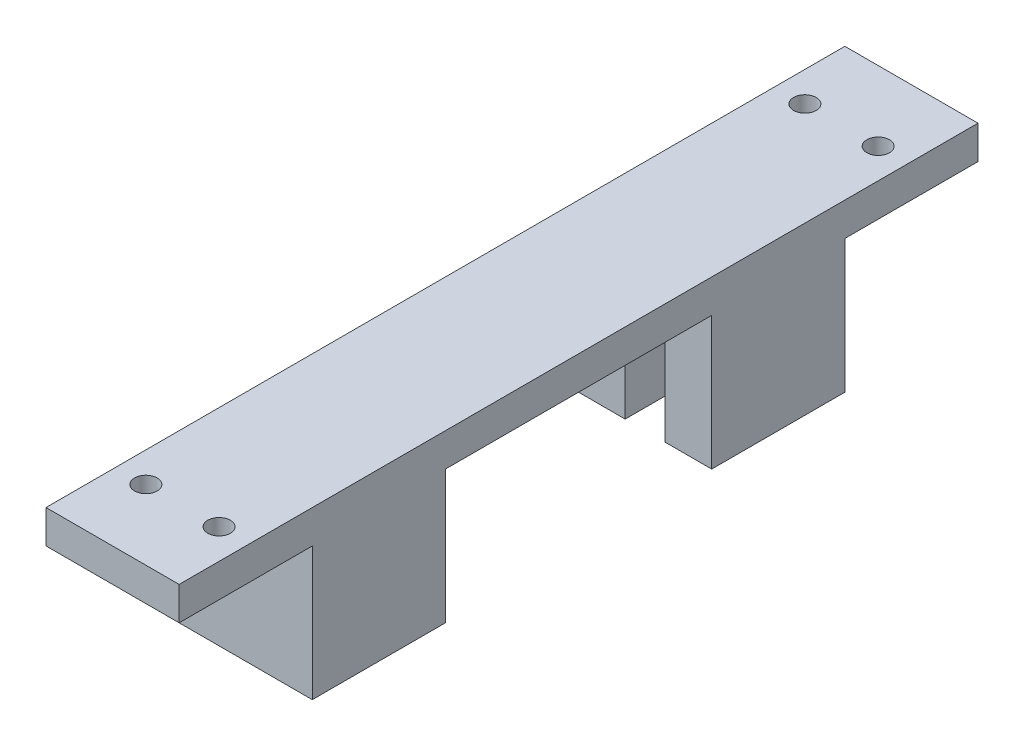
ISO-10303-21;
HEADER;
FILE_DESCRIPTION(('STEP AP214'),'2;1');
FILE_NAME('part.step','',(''),(''),'','','');
FILE_SCHEMA(('AUTOMOTIVE_DESIGN { 1 0 10303 214 1 1 1 1 }'));
ENDSEC;
DATA;
#1=APPLICATION_CONTEXT('core data for automotive mechanical design processes');
#2=APPLICATION_PROTOCOL_DEFINITION('international standard','automotive_design',2000,#1);
#3=PRODUCT_CONTEXT('',#1,'mechanical');
#4=PRODUCT('Part','Part','',(#3));
#5=PRODUCT_RELATED_PRODUCT_CATEGORY('part','',(#4));
#6=PRODUCT_DEFINITION_FORMATION('','',#4);
#7=PRODUCT_DEFINITION_CONTEXT('part definition',#1,'design');
#8=PRODUCT_DEFINITION('design','',#6,#7);
#9=PRODUCT_DEFINITION_SHAPE('','',#8);
#10=(LENGTH_UNIT() NAMED_UNIT(*) SI_UNIT(.MILLI.,.METRE.));
#11=(NAMED_UNIT(*) PLANE_ANGLE_UNIT() SI_UNIT($,.RADIAN.));
#12=(NAMED_UNIT(*) SI_UNIT($,.STERADIAN.) SOLID_ANGLE_UNIT());
#13=UNCERTAINTY_MEASURE_WITH_UNIT(LENGTH_MEASURE(1.E-05),#10,'distance_accuracy_value','');
#14=(GEOMETRIC_REPRESENTATION_CONTEXT(3) GLOBAL_UNCERTAINTY_ASSIGNED_CONTEXT((#13)) GLOBAL_UNIT_ASSIGNED_CONTEXT((#10,
#11,#12)) REPRESENTATION_CONTEXT('',''));
#15=CARTESIAN_POINT('',(0.,0.,0.));
#16=DIRECTION('',(0.,0.,1.));
#17=DIRECTION('',(1.,0.,0.));
#18=AXIS2_PLACEMENT_3D('',#15,#16,#17);
#19=CARTESIAN_POINT('',(10.,-20.,-60.));
#20=DIRECTION('',(0.,0.,-1.));
#21=DIRECTION('',(-1.,0.,0.));
#22=AXIS2_PLACEMENT_3D('',#19,#20,#21);
#23=PLANE('',#22);
#24=DIRECTION('',(-1.,0.,0.));
#25=VECTOR('',#24,1.);
#26=CARTESIAN_POINT('',(10.,-20.,-60.));
#27=LINE('',#26,#25);
#28=CARTESIAN_POINT('',(-3.,-20.,-60.));
#29=VERTEX_POINT('',#28);
#30=CARTESIAN_POINT('',(-10.,-20.,-60.));
#31=VERTEX_POINT('',#30);
#32=EDGE_CURVE('E214',#29,#31,#27,.T.);
#33=ORIENTED_EDGE('',*,*,#32,.F.);
#34=DIRECTION('',(0.,-1.,0.));
#35=VECTOR('',#34,1.);
#36=CARTESIAN_POINT('',(-3.,0.,-60.));
#37=LINE('',#36,#35);
#38=CARTESIAN_POINT('',(-3.,0.,-60.));
#39=VERTEX_POINT('',#38);
#40=EDGE_CURVE('E205',#39,#29,#37,.T.);
#41=ORIENTED_EDGE('',*,*,#40,.F.);
#42=DIRECTION('',(-1.,0.,0.));
#43=VECTOR('',#42,1.);
#44=CARTESIAN_POINT('',(10.,0.,-60.));
#45=LINE('',#44,#43);
#46=CARTESIAN_POINT('',(-10.,0.,-60.));
#47=VERTEX_POINT('',#46);
#48=EDGE_CURVE('E193',#39,#47,#45,.T.);
#49=ORIENTED_EDGE('',*,*,#48,.T.);
#50=DIRECTION('',(0.,1.,0.));
#51=VECTOR('',#50,1.);
#52=CARTESIAN_POINT('',(-10.,-20.,-60.));
#53=LINE('',#52,#51);
#54=EDGE_CURVE('E231',#31,#47,#53,.T.);
#55=ORIENTED_EDGE('',*,*,#54,.F.);
#56=EDGE_LOOP('',(#33,#41,#49,#55));
#57=FACE_BOUND('',#56,.T.);
#58=ADVANCED_FACE('F33',(#57),#23,.F.);
#59=CARTESIAN_POINT('',(0.,0.,0.));
#60=DIRECTION('',(0.,-1.,0.));
#61=DIRECTION('',(0.,0.,-1.));
#62=AXIS2_PLACEMENT_3D('',#59,#60,#61);
#63=PLANE('',#62);
#64=DIRECTION('',(0.,0.,1.));
#65=VECTOR('',#64,1.);
#66=CARTESIAN_POINT('',(-10.,0.,-80.));
#67=LINE('',#66,#65);
#68=CARTESIAN_POINT('',(-10.,0.,-20.));
#69=VERTEX_POINT('',#68);
#70=EDGE_CURVE('E261',#47,#69,#67,.T.);
#71=ORIENTED_EDGE('',*,*,#70,.F.);
#72=ORIENTED_EDGE('',*,*,#48,.F.);
#73=DIRECTION('',(0.,0.,-1.));
#74=VECTOR('',#73,1.);
#75=CARTESIAN_POINT('',(-3.,0.,-60.));
#76=LINE('',#75,#74);
#77=CARTESIAN_POINT('',(-3.,0.,-76.));
#78=VERTEX_POINT('',#77);
#79=EDGE_CURVE('E175',#39,#78,#76,.T.);
#80=ORIENTED_EDGE('',*,*,#79,.T.);
#81=DIRECTION('',(1.,0.,0.));
#82=VECTOR('',#81,1.);
#83=CARTESIAN_POINT('',(-3.,0.,-76.));
#84=LINE('',#83,#82);
#85=CARTESIAN_POINT('',(3.,0.,-76.));
#86=VERTEX_POINT('',#85);
#87=EDGE_CURVE('E184',#78,#86,#84,.T.);
#88=ORIENTED_EDGE('',*,*,#87,.T.);
#89=DIRECTION('',(0.,0.,1.));
#90=VECTOR('',#89,1.);
#91=CARTESIAN_POINT('',(3.,0.,-60.));
#92=LINE('',#91,#90);
#93=CARTESIAN_POINT('',(3.,0.,-60.));
#94=VERTEX_POINT('',#93);
#95=EDGE_CURVE('E181',#86,#94,#92,.T.);
#96=ORIENTED_EDGE('',*,*,#95,.T.);
#97=CARTESIAN_POINT('',(10.,0.,-60.));
#98=VERTEX_POINT('',#97);
#99=EDGE_CURVE('E224',#98,#94,#45,.T.);
#100=ORIENTED_EDGE('',*,*,#99,.F.);
#101=DIRECTION('',(0.,0.,1.));
#102=VECTOR('',#101,1.);
#103=CARTESIAN_POINT('',(10.,0.,-80.));
#104=LINE('',#103,#102);
#105=CARTESIAN_POINT('',(10.,0.,-20.));
#106=VERTEX_POINT('',#105);
#107=EDGE_CURVE('E37',#98,#106,#104,.T.);
#108=ORIENTED_EDGE('',*,*,#107,.T.);
#109=DIRECTION('',(-1.,0.,0.));
#110=VECTOR('',#109,1.);
#111=CARTESIAN_POINT('',(-10.,0.,-20.));
#112=LINE('',#111,#110);
#113=CARTESIAN_POINT('',(3.,0.,-20.));
#114=VERTEX_POINT('',#113);
#115=EDGE_CURVE('E248',#106,#114,#112,.T.);
#116=ORIENTED_EDGE('',*,*,#115,.T.);
#117=DIRECTION('',(0.,0.,1.));
#118=VECTOR('',#117,1.);
#119=CARTESIAN_POINT('',(3.,0.,-20.));
#120=LINE('',#119,#118);
#121=CARTESIAN_POINT('',(3.,0.,-4.));
#122=VERTEX_POINT('',#121);
#123=EDGE_CURVE('E281',#114,#122,#120,.T.);
#124=ORIENTED_EDGE('',*,*,#123,.T.);
#125=DIRECTION('',(-1.,0.,0.));
#126=VECTOR('',#125,1.);
#127=CARTESIAN_POINT('',(3.,0.,-4.));
#128=LINE('',#127,#126);
#129=CARTESIAN_POINT('',(-3.,0.,-4.));
#130=VERTEX_POINT('',#129);
#131=EDGE_CURVE('E284',#122,#130,#128,.T.);
#132=ORIENTED_EDGE('',*,*,#131,.T.);
#133=DIRECTION('',(0.,0.,-1.));
#134=VECTOR('',#133,1.);
#135=CARTESIAN_POINT('',(-3.,0.,-20.));
#136=LINE('',#135,#134);
#137=CARTESIAN_POINT('',(-3.,0.,-20.));
#138=VERTEX_POINT('',#137);
#139=EDGE_CURVE('E288',#130,#138,#136,.T.);
#140=ORIENTED_EDGE('',*,*,#139,.T.);
#141=EDGE_CURVE('E11',#138,#69,#112,.T.);
#142=ORIENTED_EDGE('',*,*,#141,.T.);
#143=EDGE_LOOP('',(#71,#72,#80,#88,#96,#100,#108,#116,#124,#132,#140,#142));
#144=FACE_BOUND('',#143,.T.);
#145=ADVANCED_FACE('F192',(#144),#63,.T.);
#146=CARTESIAN_POINT('',(5.5,0.,-89.5));
#147=DIRECTION('',(0.,-1.,0.));
#148=DIRECTION('',(0.,0.,-1.));
#149=AXIS2_PLACEMENT_3D('',#146,#147,#148);
#150=CIRCLE('',#149,1.69999999999999);
#151=CARTESIAN_POINT('',(5.5,0.,-91.2));
#152=VERTEX_POINT('',#151);
#153=EDGE_CURVE('E716',#152,#152,#150,.T.);
#154=ORIENTED_EDGE('',*,*,#153,.F.);
#155=EDGE_LOOP('',(#154));
#156=FACE_BOUND('',#155,.T.);
#157=CARTESIAN_POINT('',(-5.5,0.,-89.5));
#158=DIRECTION('',(0.,-1.,0.));
#159=DIRECTION('',(0.,0.,-1.));
#160=AXIS2_PLACEMENT_3D('',#157,#158,#159);
#161=CIRCLE('',#160,1.69999999999999);
#162=CARTESIAN_POINT('',(-5.5,0.,-91.2));
#163=VERTEX_POINT('',#162);
#164=EDGE_CURVE('E718',#163,#163,#161,.T.);
#165=ORIENTED_EDGE('',*,*,#164,.F.);
#166=EDGE_LOOP('',(#165));
#167=FACE_BOUND('',#166,.T.);
#168=CARTESIAN_POINT('',(10.,0.,-100.));
#169=VERTEX_POINT('',#168);
#170=CARTESIAN_POINT('',(10.,0.,-80.));
#171=VERTEX_POINT('',#170);
#172=EDGE_CURVE('E269',#169,#171,#104,.T.);
#173=ORIENTED_EDGE('',*,*,#172,.T.);
#174=DIRECTION('',(1.,0.,0.));
#175=VECTOR('',#174,1.);
#176=CARTESIAN_POINT('',(10.,0.,-80.));
#177=LINE('',#176,#175);
#178=CARTESIAN_POINT('',(-10.,0.,-80.));
#179=VERTEX_POINT('',#178);
#180=EDGE_CURVE('E215',#179,#171,#177,.T.);
#181=ORIENTED_EDGE('',*,*,#180,.F.);
#182=CARTESIAN_POINT('',(-10.,0.,-100.));
#183=VERTEX_POINT('',#182);
#184=EDGE_CURVE('E258',#183,#179,#67,.T.);
#185=ORIENTED_EDGE('',*,*,#184,.F.);
#186=DIRECTION('',(-1.,0.,0.));
#187=VECTOR('',#186,1.);
#188=CARTESIAN_POINT('',(10.,0.,-100.));
#189=LINE('',#188,#187);
#190=EDGE_CURVE('E239',#169,#183,#189,.T.);
#191=ORIENTED_EDGE('',*,*,#190,.F.);
#192=EDGE_LOOP('',(#173,#181,#185,#191));
#193=FACE_BOUND('',#192,.T.);
#194=ADVANCED_FACE('F427',(#156,#167,#193),#63,.T.);
#195=CARTESIAN_POINT('',(-10.,5.,-20.));
#196=DIRECTION('',(0.,0.,-1.));
#197=DIRECTION('',(-1.,0.,0.));
#198=AXIS2_PLACEMENT_3D('',#195,#196,#197);
#199=PLANE('',#198);
#200=ORIENTED_EDGE('',*,*,#115,.F.);
#201=DIRECTION('',(0.,-1.,0.));
#202=VECTOR('',#201,1.);
#203=CARTESIAN_POINT('',(10.,5.,-20.));
#204=LINE('',#203,#202);
#205=CARTESIAN_POINT('',(10.,-20.,-20.));
#206=VERTEX_POINT('',#205);
#207=EDGE_CURVE('E255',#106,#206,#204,.T.);
#208=ORIENTED_EDGE('',*,*,#207,.T.);
#209=DIRECTION('',(1.,0.,0.));
#210=VECTOR('',#209,1.);
#211=CARTESIAN_POINT('',(10.,-20.,-20.));
#212=LINE('',#211,#210);
#213=CARTESIAN_POINT('',(3.,-20.,-20.));
#214=VERTEX_POINT('',#213);
#215=EDGE_CURVE('E318',#214,#206,#212,.T.);
#216=ORIENTED_EDGE('',*,*,#215,.F.);
#217=DIRECTION('',(0.,-1.,0.));
#218=VECTOR('',#217,1.);
#219=CARTESIAN_POINT('',(3.,0.,-20.));
#220=LINE('',#219,#218);
#221=EDGE_CURVE('E276',#114,#214,#220,.T.);
#222=ORIENTED_EDGE('',*,*,#221,.F.);
#223=EDGE_LOOP('',(#200,#208,#216,#222));
#224=FACE_BOUND('',#223,.T.);
#225=ADVANCED_FACE('F411',(#224),#199,.T.);
#226=CARTESIAN_POINT('',(0.,5.,0.));
#227=DIRECTION('',(0.,1.,0.));
#228=DIRECTION('',(0.,0.,1.));
#229=AXIS2_PLACEMENT_3D('',#226,#227,#228);
#230=PLANE('',#229);
#231=CARTESIAN_POINT('',(5.5,5.,-89.5));
#232=DIRECTION('',(0.,-1.,0.));
#233=DIRECTION('',(0.,0.,-1.));
#234=AXIS2_PLACEMENT_3D('',#231,#232,#233);
#235=CIRCLE('',#234,1.7);
#236=CARTESIAN_POINT('',(5.5,5.,-91.2));
#237=VERTEX_POINT('',#236);
#238=EDGE_CURVE('E714',#237,#237,#235,.T.);
#239=ORIENTED_EDGE('',*,*,#238,.T.);
#240=EDGE_LOOP('',(#239));
#241=FACE_BOUND('',#240,.T.);
#242=CARTESIAN_POINT('',(-5.5,5.,-89.5));
#243=DIRECTION('',(0.,-1.,0.));
#244=DIRECTION('',(0.,0.,-1.));
#245=AXIS2_PLACEMENT_3D('',#242,#243,#244);
#246=CIRCLE('',#245,1.7);
#247=CARTESIAN_POINT('',(-5.5,5.,-91.2));
#248=VERTEX_POINT('',#247);
#249=EDGE_CURVE('E199',#248,#248,#246,.T.);
#250=ORIENTED_EDGE('',*,*,#249,.T.);
#251=EDGE_LOOP('',(#250));
#252=FACE_BOUND('',#251,.T.);
#253=DIRECTION('',(1.,0.,0.));
#254=VECTOR('',#253,1.);
#255=CARTESIAN_POINT('',(-10.,5.,20.));
#256=LINE('',#255,#254);
#257=CARTESIAN_POINT('',(-10.,5.,20.));
#258=VERTEX_POINT('',#257);
#259=CARTESIAN_POINT('',(10.,5.,20.));
#260=VERTEX_POINT('',#259);
#261=EDGE_CURVE('E325',#258,#260,#256,.T.);
#262=ORIENTED_EDGE('',*,*,#261,.T.);
#263=DIRECTION('',(0.,0.,-1.));
#264=VECTOR('',#263,1.);
#265=CARTESIAN_POINT('',(10.,5.,20.));
#266=LINE('',#265,#264);
#267=CARTESIAN_POINT('',(10.,5.,-100.));
#268=VERTEX_POINT('',#267);
#269=EDGE_CURVE('E359',#260,#268,#266,.T.);
#270=ORIENTED_EDGE('',*,*,#269,.T.);
#271=DIRECTION('',(1.,0.,0.));
#272=VECTOR('',#271,1.);
#273=CARTESIAN_POINT('',(10.,5.,-100.));
#274=LINE('',#273,#272);
#275=CARTESIAN_POINT('',(-10.,5.,-100.));
#276=VERTEX_POINT('',#275);
#277=EDGE_CURVE('E245',#276,#268,#274,.T.);
#278=ORIENTED_EDGE('',*,*,#277,.F.);
#279=DIRECTION('',(0.,0.,-1.));
#280=VECTOR('',#279,1.);
#281=CARTESIAN_POINT('',(-10.,5.,20.));
#282=LINE('',#281,#280);
#283=EDGE_CURVE('E358',#258,#276,#282,.T.);
#284=ORIENTED_EDGE('',*,*,#283,.F.);
#285=EDGE_LOOP('',(#262,#270,#278,#284));
#286=FACE_BOUND('',#285,.T.);
#287=CARTESIAN_POINT('',(-5.5,5.,9.5));
#288=DIRECTION('',(0.,1.,0.));
#289=DIRECTION('',(0.,0.,1.));
#290=AXIS2_PLACEMENT_3D('',#287,#288,#289);
#291=CIRCLE('',#290,1.69999999999999);
#292=CARTESIAN_POINT('',(-5.5,5.,11.2));
#293=VERTEX_POINT('',#292);
#294=EDGE_CURVE('E301',#293,#293,#291,.F.);
#295=ORIENTED_EDGE('',*,*,#294,.T.);
#296=EDGE_LOOP('',(#295));
#297=FACE_BOUND('',#296,.T.);
#298=CARTESIAN_POINT('',(5.5,5.,9.5));
#299=DIRECTION('',(0.,1.,0.));
#300=DIRECTION('',(0.,0.,1.));
#301=AXIS2_PLACEMENT_3D('',#298,#299,#300);
#302=CIRCLE('',#301,1.69999999999999);
#303=CARTESIAN_POINT('',(5.5,5.,11.2));
#304=VERTEX_POINT('',#303);
#305=EDGE_CURVE('E473',#304,#304,#302,.F.);
#306=ORIENTED_EDGE('',*,*,#305,.T.);
#307=EDGE_LOOP('',(#306));
#308=FACE_BOUND('',#307,.T.);
#309=ADVANCED_FACE('F366',(#241,#252,#286,#297,#308),#230,.T.);
#310=CARTESIAN_POINT('',(0.,0.,0.));
#311=DIRECTION('',(0.,1.,0.));
#312=DIRECTION('',(0.,0.,1.));
#313=AXIS2_PLACEMENT_3D('',#310,#311,#312);
#314=PLANE('',#313);
#315=CARTESIAN_POINT('',(5.5,0.,9.5));
#316=DIRECTION('',(0.,-1.,0.));
#317=DIRECTION('',(0.,0.,-1.));
#318=AXIS2_PLACEMENT_3D('',#315,#316,#317);
#319=CIRCLE('',#318,1.69999999999999);
#320=CARTESIAN_POINT('',(5.5,0.,7.80000000000001));
#321=VERTEX_POINT('',#320);
#322=EDGE_CURVE('E273',#321,#321,#319,.T.);
#323=ORIENTED_EDGE('',*,*,#322,.F.);
#324=EDGE_LOOP('',(#323));
#325=FACE_BOUND('',#324,.T.);
#326=CARTESIAN_POINT('',(-5.5,0.,9.5));
#327=DIRECTION('',(0.,-1.,0.));
#328=DIRECTION('',(0.,0.,-1.));
#329=AXIS2_PLACEMENT_3D('',#326,#327,#328);
#330=CIRCLE('',#329,1.69999999999999);
#331=CARTESIAN_POINT('',(-5.5,0.,7.80000000000001));
#332=VERTEX_POINT('',#331);
#333=EDGE_CURVE('E471',#332,#332,#330,.T.);
#334=ORIENTED_EDGE('',*,*,#333,.F.);
#335=EDGE_LOOP('',(#334));
#336=FACE_BOUND('',#335,.T.);
#337=DIRECTION('',(-1.,0.,0.));
#338=VECTOR('',#337,1.);
#339=CARTESIAN_POINT('',(10.,0.,0.));
#340=LINE('',#339,#338);
#341=CARTESIAN_POINT('',(10.,0.,0.));
#342=VERTEX_POINT('',#341);
#343=CARTESIAN_POINT('',(-10.,0.,0.));
#344=VERTEX_POINT('',#343);
#345=EDGE_CURVE('E278',#342,#344,#340,.T.);
#346=ORIENTED_EDGE('',*,*,#345,.F.);
#347=DIRECTION('',(0.,0.,-1.));
#348=VECTOR('',#347,1.);
#349=CARTESIAN_POINT('',(10.,0.,20.));
#350=LINE('',#349,#348);
#351=CARTESIAN_POINT('',(10.,0.,20.));
#352=VERTEX_POINT('',#351);
#353=EDGE_CURVE('E331',#352,#342,#350,.T.);
#354=ORIENTED_EDGE('',*,*,#353,.F.);
#355=DIRECTION('',(1.,0.,0.));
#356=VECTOR('',#355,1.);
#357=CARTESIAN_POINT('',(-10.,0.,20.));
#358=LINE('',#357,#356);
#359=CARTESIAN_POINT('',(-10.,0.,20.));
#360=VERTEX_POINT('',#359);
#361=EDGE_CURVE('E341',#360,#352,#358,.T.);
#362=ORIENTED_EDGE('',*,*,#361,.F.);
#363=DIRECTION('',(0.,0.,-1.));
#364=VECTOR('',#363,1.);
#365=CARTESIAN_POINT('',(-10.,0.,20.));
#366=LINE('',#365,#364);
#367=EDGE_CURVE('E352',#360,#344,#366,.T.);
#368=ORIENTED_EDGE('',*,*,#367,.T.);
#369=EDGE_LOOP('',(#346,#354,#362,#368));
#370=FACE_BOUND('',#369,.T.);
#371=ADVANCED_FACE('F383',(#325,#336,#370),#314,.F.);
#372=CARTESIAN_POINT('',(-10.,5.,20.));
#373=DIRECTION('',(0.,0.,-1.));
#374=DIRECTION('',(-1.,0.,0.));
#375=AXIS2_PLACEMENT_3D('',#372,#373,#374);
#376=PLANE('',#375);
#377=ORIENTED_EDGE('',*,*,#361,.T.);
#378=DIRECTION('',(0.,-1.,0.));
#379=VECTOR('',#378,1.);
#380=CARTESIAN_POINT('',(10.,5.,20.));
#381=LINE('',#380,#379);
#382=EDGE_CURVE('E43',#260,#352,#381,.T.);
#383=ORIENTED_EDGE('',*,*,#382,.F.);
#384=ORIENTED_EDGE('',*,*,#261,.F.);
#385=DIRECTION('',(0.,-1.,0.));
#386=VECTOR('',#385,1.);
#387=CARTESIAN_POINT('',(-10.,5.,20.));
#388=LINE('',#387,#386);
#389=EDGE_CURVE('E345',#258,#360,#388,.T.);
#390=ORIENTED_EDGE('',*,*,#389,.T.);
#391=EDGE_LOOP('',(#377,#383,#384,#390));
#392=FACE_BOUND('',#391,.T.);
#393=ADVANCED_FACE('F35',(#392),#376,.F.);
#394=CARTESIAN_POINT('',(10.,5.,20.));
#395=DIRECTION('',(-1.,0.,0.));
#396=DIRECTION('',(0.,0.,1.));
#397=AXIS2_PLACEMENT_3D('',#394,#395,#396);
#398=PLANE('',#397);
#399=ORIENTED_EDGE('',*,*,#353,.T.);
#400=DIRECTION('',(0.,1.,0.));
#401=VECTOR('',#400,1.);
#402=CARTESIAN_POINT('',(10.,-20.,0.));
#403=LINE('',#402,#401);
#404=CARTESIAN_POINT('',(10.,-20.,0.));
#405=VERTEX_POINT('',#404);
#406=EDGE_CURVE('E336',#405,#342,#403,.T.);
#407=ORIENTED_EDGE('',*,*,#406,.F.);
#408=DIRECTION('',(0.,0.,1.));
#409=VECTOR('',#408,1.);
#410=CARTESIAN_POINT('',(10.,-20.,-20.));
#411=LINE('',#410,#409);
#412=EDGE_CURVE('E310',#206,#405,#411,.T.);
#413=ORIENTED_EDGE('',*,*,#412,.F.);
#414=ORIENTED_EDGE('',*,*,#207,.F.);
#415=ORIENTED_EDGE('',*,*,#107,.F.);
#416=DIRECTION('',(0.,1.,0.));
#417=VECTOR('',#416,1.);
#418=CARTESIAN_POINT('',(10.,-20.,-60.));
#419=LINE('',#418,#417);
#420=CARTESIAN_POINT('',(10.,-20.,-60.));
#421=VERTEX_POINT('',#420);
#422=EDGE_CURVE('E234',#421,#98,#419,.T.);
#423=ORIENTED_EDGE('',*,*,#422,.F.);
#424=DIRECTION('',(0.,0.,1.));
#425=VECTOR('',#424,1.);
#426=CARTESIAN_POINT('',(10.,-20.,-60.));
#427=LINE('',#426,#425);
#428=CARTESIAN_POINT('',(10.,-20.,-80.));
#429=VERTEX_POINT('',#428);
#430=EDGE_CURVE('E211',#429,#421,#427,.T.);
#431=ORIENTED_EDGE('',*,*,#430,.F.);
#432=DIRECTION('',(0.,1.,0.));
#433=VECTOR('',#432,1.);
#434=CARTESIAN_POINT('',(10.,-20.,-80.));
#435=LINE('',#434,#433);
#436=EDGE_CURVE('E223',#429,#171,#435,.T.);
#437=ORIENTED_EDGE('',*,*,#436,.T.);
#438=ORIENTED_EDGE('',*,*,#172,.F.);
#439=DIRECTION('',(0.,-1.,0.));
#440=VECTOR('',#439,1.);
#441=CARTESIAN_POINT('',(10.,5.,-100.));
#442=LINE('',#441,#440);
#443=EDGE_CURVE('E236',#268,#169,#442,.T.);
#444=ORIENTED_EDGE('',*,*,#443,.F.);
#445=ORIENTED_EDGE('',*,*,#269,.F.);
#446=ORIENTED_EDGE('',*,*,#382,.T.);
#447=EDGE_LOOP('',(#399,#407,#413,#414,#415,#423,#431,#437,#438,#444,#445,#446));
#448=FACE_BOUND('',#447,.T.);
#449=ADVANCED_FACE('F372',(#448),#398,.F.);
#450=ORIENTED_EDGE('',*,*,#141,.F.);
#451=DIRECTION('',(0.,-1.,0.));
#452=VECTOR('',#451,1.);
#453=CARTESIAN_POINT('',(-3.,0.,-20.));
#454=LINE('',#453,#452);
#455=CARTESIAN_POINT('',(-3.,-20.,-20.));
#456=VERTEX_POINT('',#455);
#457=EDGE_CURVE('E264',#138,#456,#454,.T.);
#458=ORIENTED_EDGE('',*,*,#457,.T.);
#459=CARTESIAN_POINT('',(-10.,-20.,-20.));
#460=VERTEX_POINT('',#459);
#461=EDGE_CURVE('E319',#460,#456,#212,.T.);
#462=ORIENTED_EDGE('',*,*,#461,.F.);
#463=DIRECTION('',(0.,-1.,0.));
#464=VECTOR('',#463,1.);
#465=CARTESIAN_POINT('',(-10.,5.,-20.));
#466=LINE('',#465,#464);
#467=EDGE_CURVE('E343',#69,#460,#466,.T.);
#468=ORIENTED_EDGE('',*,*,#467,.F.);
#469=EDGE_LOOP('',(#450,#458,#462,#468));
#470=FACE_BOUND('',#469,.T.);
#471=ADVANCED_FACE('F396',(#470),#199,.T.);
#472=CARTESIAN_POINT('',(-10.,5.,20.));
#473=DIRECTION('',(-1.,0.,0.));
#474=DIRECTION('',(0.,0.,1.));
#475=AXIS2_PLACEMENT_3D('',#472,#473,#474);
#476=PLANE('',#475);
#477=ORIENTED_EDGE('',*,*,#367,.F.);
#478=ORIENTED_EDGE('',*,*,#389,.F.);
#479=ORIENTED_EDGE('',*,*,#283,.T.);
#480=DIRECTION('',(0.,1.,0.));
#481=VECTOR('',#480,1.);
#482=CARTESIAN_POINT('',(-10.,5.,-100.));
#483=LINE('',#482,#481);
#484=EDGE_CURVE('E242',#183,#276,#483,.T.);
#485=ORIENTED_EDGE('',*,*,#484,.F.);
#486=ORIENTED_EDGE('',*,*,#184,.T.);
#487=DIRECTION('',(0.,1.,0.));
#488=VECTOR('',#487,1.);
#489=CARTESIAN_POINT('',(-10.,-20.,-80.));
#490=LINE('',#489,#488);
#491=CARTESIAN_POINT('',(-10.,-20.,-80.));
#492=VERTEX_POINT('',#491);
#493=EDGE_CURVE('E59',#492,#179,#490,.T.);
#494=ORIENTED_EDGE('',*,*,#493,.F.);
#495=DIRECTION('',(0.,0.,-1.));
#496=VECTOR('',#495,1.);
#497=CARTESIAN_POINT('',(-10.,-20.,-60.));
#498=LINE('',#497,#496);
#499=EDGE_CURVE('E219',#31,#492,#498,.T.);
#500=ORIENTED_EDGE('',*,*,#499,.F.);
#501=ORIENTED_EDGE('',*,*,#54,.T.);
#502=ORIENTED_EDGE('',*,*,#70,.T.);
#503=ORIENTED_EDGE('',*,*,#467,.T.);
#504=DIRECTION('',(0.,0.,-1.));
#505=VECTOR('',#504,1.);
#506=CARTESIAN_POINT('',(-10.,-20.,-20.));
#507=LINE('',#506,#505);
#508=CARTESIAN_POINT('',(-10.,-20.,0.));
#509=VERTEX_POINT('',#508);
#510=EDGE_CURVE('E315',#509,#460,#507,.T.);
#511=ORIENTED_EDGE('',*,*,#510,.F.);
#512=DIRECTION('',(0.,1.,0.));
#513=VECTOR('',#512,1.);
#514=CARTESIAN_POINT('',(-10.,-20.,0.));
#515=LINE('',#514,#513);
#516=EDGE_CURVE('E322',#509,#344,#515,.T.);
#517=ORIENTED_EDGE('',*,*,#516,.T.);
#518=EDGE_LOOP('',(#477,#478,#479,#485,#486,#494,#500,#501,#502,#503,#511,#517));
#519=FACE_BOUND('',#518,.T.);
#520=ADVANCED_FACE('F381',(#519),#476,.T.);
#521=CARTESIAN_POINT('',(10.,-20.,0.));
#522=DIRECTION('',(0.,0.,-1.));
#523=DIRECTION('',(-1.,0.,0.));
#524=AXIS2_PLACEMENT_3D('',#521,#522,#523);
#525=PLANE('',#524);
#526=ORIENTED_EDGE('',*,*,#345,.T.);
#527=ORIENTED_EDGE('',*,*,#516,.F.);
#528=DIRECTION('',(-1.,0.,0.));
#529=VECTOR('',#528,1.);
#530=CARTESIAN_POINT('',(10.,-20.,0.));
#531=LINE('',#530,#529);
#532=EDGE_CURVE('E313',#405,#509,#531,.T.);
#533=ORIENTED_EDGE('',*,*,#532,.F.);
#534=ORIENTED_EDGE('',*,*,#406,.T.);
#535=EDGE_LOOP('',(#526,#527,#533,#534));
#536=FACE_BOUND('',#535,.T.);
#537=ADVANCED_FACE('F386',(#536),#525,.F.);
#538=CARTESIAN_POINT('',(0.,-20.,0.));
#539=DIRECTION('',(0.,-1.,0.));
#540=DIRECTION('',(0.,0.,-1.));
#541=AXIS2_PLACEMENT_3D('',#538,#539,#540);
#542=PLANE('',#541);
#543=DIRECTION('',(0.,0.,1.));
#544=VECTOR('',#543,1.);
#545=CARTESIAN_POINT('',(3.,-20.,-20.));
#546=LINE('',#545,#544);
#547=CARTESIAN_POINT('',(3.,-20.,-4.));
#548=VERTEX_POINT('',#547);
#549=EDGE_CURVE('E303',#214,#548,#546,.T.);
#550=ORIENTED_EDGE('',*,*,#549,.F.);
#551=ORIENTED_EDGE('',*,*,#215,.T.);
#552=ORIENTED_EDGE('',*,*,#412,.T.);
#553=ORIENTED_EDGE('',*,*,#532,.T.);
#554=ORIENTED_EDGE('',*,*,#510,.T.);
#555=ORIENTED_EDGE('',*,*,#461,.T.);
#556=DIRECTION('',(0.,0.,-1.));
#557=VECTOR('',#556,1.);
#558=CARTESIAN_POINT('',(-3.,-20.,-20.));
#559=LINE('',#558,#557);
#560=CARTESIAN_POINT('',(-3.,-20.,-4.));
#561=VERTEX_POINT('',#560);
#562=EDGE_CURVE('E285',#561,#456,#559,.T.);
#563=ORIENTED_EDGE('',*,*,#562,.F.);
#564=DIRECTION('',(-1.,0.,0.));
#565=VECTOR('',#564,1.);
#566=CARTESIAN_POINT('',(3.,-20.,-4.));
#567=LINE('',#566,#565);
#568=EDGE_CURVE('E305',#548,#561,#567,.T.);
#569=ORIENTED_EDGE('',*,*,#568,.F.);
#570=EDGE_LOOP('',(#550,#551,#552,#553,#554,#555,#563,#569));
#571=FACE_BOUND('',#570,.T.);
#572=ADVANCED_FACE('F392',(#571),#542,.T.);
#573=CARTESIAN_POINT('',(3.,0.,-20.));
#574=DIRECTION('',(1.,0.,0.));
#575=DIRECTION('',(0.,0.,-1.));
#576=AXIS2_PLACEMENT_3D('',#573,#574,#575);
#577=PLANE('',#576);
#578=ORIENTED_EDGE('',*,*,#549,.T.);
#579=DIRECTION('',(0.,-1.,0.));
#580=VECTOR('',#579,1.);
#581=CARTESIAN_POINT('',(3.,0.,-4.));
#582=LINE('',#581,#580);
#583=EDGE_CURVE('E290',#122,#548,#582,.T.);
#584=ORIENTED_EDGE('',*,*,#583,.F.);
#585=ORIENTED_EDGE('',*,*,#123,.F.);
#586=ORIENTED_EDGE('',*,*,#221,.T.);
#587=EDGE_LOOP('',(#578,#584,#585,#586));
#588=FACE_BOUND('',#587,.T.);
#589=ADVANCED_FACE('F406',(#588),#577,.F.);
#590=CARTESIAN_POINT('',(-3.,0.,-20.));
#591=DIRECTION('',(-1.,0.,0.));
#592=DIRECTION('',(0.,0.,1.));
#593=AXIS2_PLACEMENT_3D('',#590,#591,#592);
#594=PLANE('',#593);
#595=ORIENTED_EDGE('',*,*,#562,.T.);
#596=ORIENTED_EDGE('',*,*,#457,.F.);
#597=ORIENTED_EDGE('',*,*,#139,.F.);
#598=DIRECTION('',(0.,-1.,0.));
#599=VECTOR('',#598,1.);
#600=CARTESIAN_POINT('',(-3.,0.,-4.));
#601=LINE('',#600,#599);
#602=EDGE_CURVE('E295',#130,#561,#601,.T.);
#603=ORIENTED_EDGE('',*,*,#602,.T.);
#604=EDGE_LOOP('',(#595,#596,#597,#603));
#605=FACE_BOUND('',#604,.T.);
#606=ADVANCED_FACE('F399',(#605),#594,.F.);
#607=CARTESIAN_POINT('',(3.,0.,-4.));
#608=DIRECTION('',(0.,0.,1.));
#609=DIRECTION('',(1.,0.,0.));
#610=AXIS2_PLACEMENT_3D('',#607,#608,#609);
#611=PLANE('',#610);
#612=ORIENTED_EDGE('',*,*,#568,.T.);
#613=ORIENTED_EDGE('',*,*,#602,.F.);
#614=ORIENTED_EDGE('',*,*,#131,.F.);
#615=ORIENTED_EDGE('',*,*,#583,.T.);
#616=EDGE_LOOP('',(#612,#613,#614,#615));
#617=FACE_BOUND('',#616,.T.);
#618=ADVANCED_FACE('F404',(#617),#611,.F.);
#619=CARTESIAN_POINT('',(-5.5,0.,9.5));
#620=DIRECTION('',(0.,-1.,0.));
#621=DIRECTION('',(0.,0.,-1.));
#622=AXIS2_PLACEMENT_3D('',#619,#620,#621);
#623=CYLINDRICAL_SURFACE('',#622,1.69999999999999);
#624=ORIENTED_EDGE('',*,*,#294,.F.);
#625=EDGE_LOOP('',(#624));
#626=FACE_BOUND('',#625,.T.);
#627=ORIENTED_EDGE('',*,*,#333,.T.);
#628=EDGE_LOOP('',(#627));
#629=FACE_BOUND('',#628,.T.);
#630=ADVANCED_FACE('F457',(#626,#629),#623,.F.);
#631=CARTESIAN_POINT('',(5.5,0.,9.5));
#632=DIRECTION('',(0.,-1.,0.));
#633=DIRECTION('',(0.,0.,-1.));
#634=AXIS2_PLACEMENT_3D('',#631,#632,#633);
#635=CYLINDRICAL_SURFACE('',#634,1.69999999999999);
#636=ORIENTED_EDGE('',*,*,#305,.F.);
#637=EDGE_LOOP('',(#636));
#638=FACE_BOUND('',#637,.T.);
#639=ORIENTED_EDGE('',*,*,#322,.T.);
#640=EDGE_LOOP('',(#639));
#641=FACE_BOUND('',#640,.T.);
#642=ADVANCED_FACE('F453',(#638,#641),#635,.F.);
#643=CARTESIAN_POINT('',(0.,0.,-100.));
#644=DIRECTION('',(0.,0.,-1.));
#645=DIRECTION('',(-1.,0.,0.));
#646=AXIS2_PLACEMENT_3D('',#643,#644,#645);
#647=PLANE('',#646);
#648=ORIENTED_EDGE('',*,*,#443,.T.);
#649=ORIENTED_EDGE('',*,*,#190,.T.);
#650=ORIENTED_EDGE('',*,*,#484,.T.);
#651=ORIENTED_EDGE('',*,*,#277,.T.);
#652=EDGE_LOOP('',(#648,#649,#650,#651));
#653=FACE_BOUND('',#652,.T.);
#654=ADVANCED_FACE('F377',(#653),#647,.T.);
#655=ORIENTED_EDGE('',*,*,#99,.T.);
#656=DIRECTION('',(0.,-1.,0.));
#657=VECTOR('',#656,1.);
#658=CARTESIAN_POINT('',(3.,0.,-60.));
#659=LINE('',#658,#657);
#660=CARTESIAN_POINT('',(3.,-20.,-60.));
#661=VERTEX_POINT('',#660);
#662=EDGE_CURVE('E207',#94,#661,#659,.T.);
#663=ORIENTED_EDGE('',*,*,#662,.T.);
#664=EDGE_CURVE('E216',#421,#661,#27,.T.);
#665=ORIENTED_EDGE('',*,*,#664,.F.);
#666=ORIENTED_EDGE('',*,*,#422,.T.);
#667=EDGE_LOOP('',(#655,#663,#665,#666));
#668=FACE_BOUND('',#667,.T.);
#669=ADVANCED_FACE('F419',(#668),#23,.F.);
#670=CARTESIAN_POINT('',(10.,-20.,-80.));
#671=DIRECTION('',(0.,0.,1.));
#672=DIRECTION('',(1.,0.,0.));
#673=AXIS2_PLACEMENT_3D('',#670,#671,#672);
#674=PLANE('',#673);
#675=ORIENTED_EDGE('',*,*,#180,.T.);
#676=ORIENTED_EDGE('',*,*,#436,.F.);
#677=DIRECTION('',(1.,0.,0.));
#678=VECTOR('',#677,1.);
#679=CARTESIAN_POINT('',(10.,-20.,-80.));
#680=LINE('',#679,#678);
#681=EDGE_CURVE('E221',#492,#429,#680,.T.);
#682=ORIENTED_EDGE('',*,*,#681,.F.);
#683=ORIENTED_EDGE('',*,*,#493,.T.);
#684=EDGE_LOOP('',(#675,#676,#682,#683));
#685=FACE_BOUND('',#684,.T.);
#686=ADVANCED_FACE('F425',(#685),#674,.F.);
#687=CARTESIAN_POINT('',(0.,-20.,0.));
#688=DIRECTION('',(0.,1.,0.));
#689=DIRECTION('',(0.,0.,1.));
#690=AXIS2_PLACEMENT_3D('',#687,#688,#689);
#691=PLANE('',#690);
#692=DIRECTION('',(1.,0.,0.));
#693=VECTOR('',#692,1.);
#694=CARTESIAN_POINT('',(-3.,-20.,-76.));
#695=LINE('',#694,#693);
#696=CARTESIAN_POINT('',(-3.,-20.,-76.));
#697=VERTEX_POINT('',#696);
#698=CARTESIAN_POINT('',(3.,-20.,-76.));
#699=VERTEX_POINT('',#698);
#700=EDGE_CURVE('E196',#697,#699,#695,.T.);
#701=ORIENTED_EDGE('',*,*,#700,.F.);
#702=DIRECTION('',(0.,0.,-1.));
#703=VECTOR('',#702,1.);
#704=CARTESIAN_POINT('',(-3.,-20.,-60.));
#705=LINE('',#704,#703);
#706=EDGE_CURVE('E51',#29,#697,#705,.T.);
#707=ORIENTED_EDGE('',*,*,#706,.F.);
#708=ORIENTED_EDGE('',*,*,#32,.T.);
#709=ORIENTED_EDGE('',*,*,#499,.T.);
#710=ORIENTED_EDGE('',*,*,#681,.T.);
#711=ORIENTED_EDGE('',*,*,#430,.T.);
#712=ORIENTED_EDGE('',*,*,#664,.T.);
#713=DIRECTION('',(0.,0.,1.));
#714=VECTOR('',#713,1.);
#715=CARTESIAN_POINT('',(3.,-20.,-60.));
#716=LINE('',#715,#714);
#717=EDGE_CURVE('E194',#699,#661,#716,.T.);
#718=ORIENTED_EDGE('',*,*,#717,.F.);
#719=EDGE_LOOP('',(#701,#707,#708,#709,#710,#711,#712,#718));
#720=FACE_BOUND('',#719,.T.);
#721=ADVANCED_FACE('F422',(#720),#691,.F.);
#722=CARTESIAN_POINT('',(-3.,0.,-60.));
#723=DIRECTION('',(-1.,0.,0.));
#724=DIRECTION('',(0.,0.,1.));
#725=AXIS2_PLACEMENT_3D('',#722,#723,#724);
#726=PLANE('',#725);
#727=ORIENTED_EDGE('',*,*,#706,.T.);
#728=DIRECTION('',(0.,-1.,0.));
#729=VECTOR('',#728,1.);
#730=CARTESIAN_POINT('',(-3.,0.,-76.));
#731=LINE('',#730,#729);
#732=EDGE_CURVE('E171',#78,#697,#731,.T.);
#733=ORIENTED_EDGE('',*,*,#732,.F.);
#734=ORIENTED_EDGE('',*,*,#79,.F.);
#735=ORIENTED_EDGE('',*,*,#40,.T.);
#736=EDGE_LOOP('',(#727,#733,#734,#735));
#737=FACE_BOUND('',#736,.T.);
#738=ADVANCED_FACE('F173',(#737),#726,.F.);
#739=CARTESIAN_POINT('',(3.,0.,-60.));
#740=DIRECTION('',(1.,0.,0.));
#741=DIRECTION('',(0.,0.,-1.));
#742=AXIS2_PLACEMENT_3D('',#739,#740,#741);
#743=PLANE('',#742);
#744=ORIENTED_EDGE('',*,*,#717,.T.);
#745=ORIENTED_EDGE('',*,*,#662,.F.);
#746=ORIENTED_EDGE('',*,*,#95,.F.);
#747=DIRECTION('',(0.,-1.,0.));
#748=VECTOR('',#747,1.);
#749=CARTESIAN_POINT('',(3.,0.,-76.));
#750=LINE('',#749,#748);
#751=EDGE_CURVE('E180',#86,#699,#750,.T.);
#752=ORIENTED_EDGE('',*,*,#751,.T.);
#753=EDGE_LOOP('',(#744,#745,#746,#752));
#754=FACE_BOUND('',#753,.T.);
#755=ADVANCED_FACE('F597',(#754),#743,.F.);
#756=CARTESIAN_POINT('',(-3.,0.,-76.));
#757=DIRECTION('',(0.,0.,-1.));
#758=DIRECTION('',(-1.,0.,0.));
#759=AXIS2_PLACEMENT_3D('',#756,#757,#758);
#760=PLANE('',#759);
#761=ORIENTED_EDGE('',*,*,#700,.T.);
#762=ORIENTED_EDGE('',*,*,#751,.F.);
#763=ORIENTED_EDGE('',*,*,#87,.F.);
#764=ORIENTED_EDGE('',*,*,#732,.T.);
#765=EDGE_LOOP('',(#761,#762,#763,#764));
#766=FACE_BOUND('',#765,.T.);
#767=ADVANCED_FACE('F185',(#766),#760,.F.);
#768=CARTESIAN_POINT('',(-5.5,0.,-89.5));
#769=DIRECTION('',(0.,-1.,0.));
#770=DIRECTION('',(0.,0.,-1.));
#771=AXIS2_PLACEMENT_3D('',#768,#769,#770);
#772=CYLINDRICAL_SURFACE('',#771,1.69999999999999);
#773=ORIENTED_EDGE('',*,*,#249,.F.);
#774=EDGE_LOOP('',(#773));
#775=FACE_BOUND('',#774,.T.);
#776=ORIENTED_EDGE('',*,*,#164,.T.);
#777=EDGE_LOOP('',(#776));
#778=FACE_BOUND('',#777,.T.);
#779=ADVANCED_FACE('F573',(#775,#778),#772,.F.);
#780=CARTESIAN_POINT('',(5.5,0.,-89.5));
#781=DIRECTION('',(0.,-1.,0.));
#782=DIRECTION('',(0.,0.,-1.));
#783=AXIS2_PLACEMENT_3D('',#780,#781,#782);
#784=CYLINDRICAL_SURFACE('',#783,1.69999999999999);
#785=ORIENTED_EDGE('',*,*,#238,.F.);
#786=EDGE_LOOP('',(#785));
#787=FACE_BOUND('',#786,.T.);
#788=ORIENTED_EDGE('',*,*,#153,.T.);
#789=EDGE_LOOP('',(#788));
#790=FACE_BOUND('',#789,.T.);
#791=ADVANCED_FACE('F578',(#787,#790),#784,.F.);
#792=CLOSED_SHELL('',(#58,#145,#194,#225,#309,#371,#393,#449,#471,#520,#537,#572,#589,#606,#618,
#630,#642,#654,#669,#686,#721,#738,#755,#767,#779,#791));
#793=MANIFOLD_SOLID_BREP('B2',#792);
#794=ADVANCED_BREP_SHAPE_REPRESENTATION('',(#18,#793),#14);
#795=SHAPE_DEFINITION_REPRESENTATION(#9,#794);
ENDSEC;
END-ISO-10303-21;
